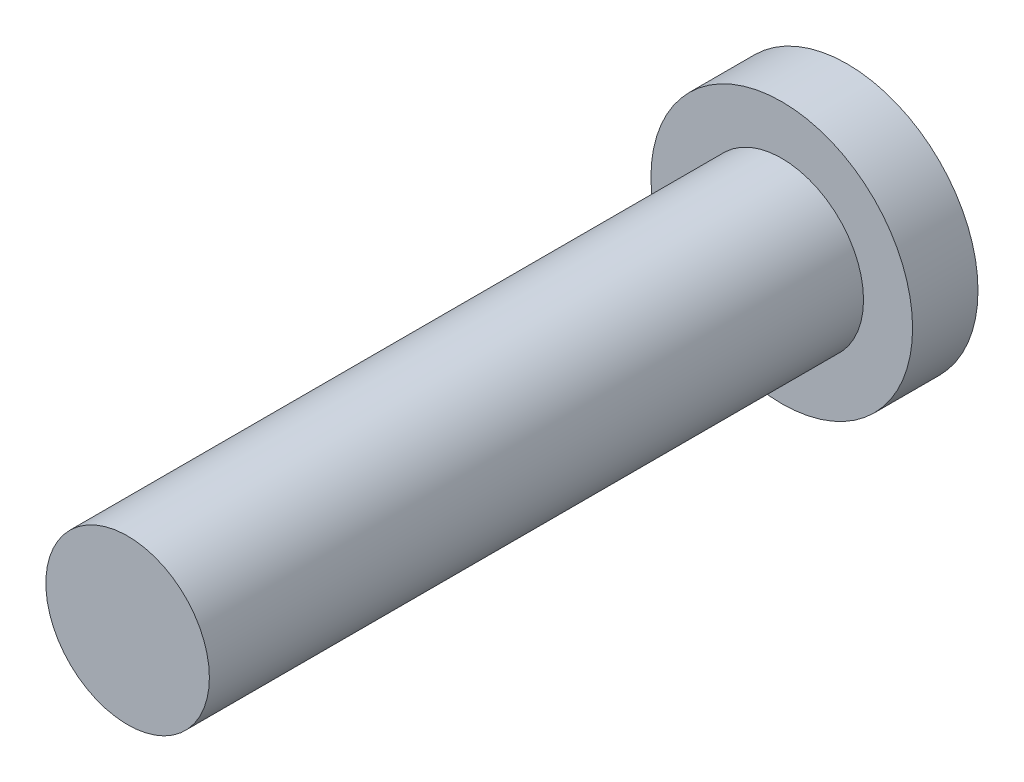
ISO-10303-21;
HEADER;
FILE_DESCRIPTION(('STEP AP214'),'2;1');
FILE_NAME('part.step','',(''),(''),'','','');
FILE_SCHEMA(('AUTOMOTIVE_DESIGN { 1 0 10303 214 1 1 1 1 }'));
ENDSEC;
DATA;
#1=APPLICATION_CONTEXT('core data for automotive mechanical design processes');
#2=APPLICATION_PROTOCOL_DEFINITION('international standard','automotive_design',2000,#1);
#3=PRODUCT_CONTEXT('',#1,'mechanical');
#4=PRODUCT('Part','Part','',(#3));
#5=PRODUCT_RELATED_PRODUCT_CATEGORY('part','',(#4));
#6=PRODUCT_DEFINITION_FORMATION('','',#4);
#7=PRODUCT_DEFINITION_CONTEXT('part definition',#1,'design');
#8=PRODUCT_DEFINITION('design','',#6,#7);
#9=PRODUCT_DEFINITION_SHAPE('','',#8);
#10=(LENGTH_UNIT() NAMED_UNIT(*) SI_UNIT(.MILLI.,.METRE.));
#11=(NAMED_UNIT(*) PLANE_ANGLE_UNIT() SI_UNIT($,.RADIAN.));
#12=(NAMED_UNIT(*) SI_UNIT($,.STERADIAN.) SOLID_ANGLE_UNIT());
#13=UNCERTAINTY_MEASURE_WITH_UNIT(LENGTH_MEASURE(1.E-05),#10,'distance_accuracy_value','');
#14=(GEOMETRIC_REPRESENTATION_CONTEXT(3) GLOBAL_UNCERTAINTY_ASSIGNED_CONTEXT((#13)) GLOBAL_UNIT_ASSIGNED_CONTEXT((#10,
#11,#12)) REPRESENTATION_CONTEXT('',''));
#15=CARTESIAN_POINT('',(0.,0.,0.));
#16=DIRECTION('',(0.,0.,1.));
#17=DIRECTION('',(1.,0.,0.));
#18=AXIS2_PLACEMENT_3D('',#15,#16,#17);
#19=CARTESIAN_POINT('',(0.,0.,2.));
#20=DIRECTION('',(0.,0.,-1.));
#21=DIRECTION('',(-1.,0.,0.));
#22=AXIS2_PLACEMENT_3D('',#19,#20,#21);
#23=CYLINDRICAL_SURFACE('',#22,4.);
#24=CARTESIAN_POINT('',(0.,0.,2.));
#25=DIRECTION('',(0.,0.,1.));
#26=DIRECTION('',(1.,0.,0.));
#27=AXIS2_PLACEMENT_3D('',#24,#25,#26);
#28=CIRCLE('',#27,4.);
#29=CARTESIAN_POINT('',(4.,0.,2.));
#30=VERTEX_POINT('',#29);
#31=EDGE_CURVE('E10',#30,#30,#28,.T.);
#32=ORIENTED_EDGE('',*,*,#31,.F.);
#33=EDGE_LOOP('',(#32));
#34=FACE_BOUND('',#33,.T.);
#35=CARTESIAN_POINT('',(0.,0.,0.));
#36=DIRECTION('',(0.,0.,1.));
#37=DIRECTION('',(1.,0.,0.));
#38=AXIS2_PLACEMENT_3D('',#35,#36,#37);
#39=CIRCLE('',#38,4.);
#40=CARTESIAN_POINT('',(4.,0.,0.));
#41=VERTEX_POINT('',#40);
#42=EDGE_CURVE('E36',#41,#41,#39,.T.);
#43=ORIENTED_EDGE('',*,*,#42,.T.);
#44=EDGE_LOOP('',(#43));
#45=FACE_BOUND('',#44,.T.);
#46=ADVANCED_FACE('F33',(#34,#45),#23,.T.);
#47=CARTESIAN_POINT('',(0.,0.,2.));
#48=DIRECTION('',(0.,0.,1.));
#49=DIRECTION('',(1.,0.,0.));
#50=AXIS2_PLACEMENT_3D('',#47,#48,#49);
#51=PLANE('',#50);
#52=CARTESIAN_POINT('',(0.,0.,2.));
#53=DIRECTION('',(0.,0.,1.));
#54=DIRECTION('',(1.,0.,0.));
#55=AXIS2_PLACEMENT_3D('',#52,#53,#54);
#56=CIRCLE('',#55,2.5);
#57=CARTESIAN_POINT('',(2.5,0.,2.));
#58=VERTEX_POINT('',#57);
#59=EDGE_CURVE('E45',#58,#58,#56,.T.);
#60=ORIENTED_EDGE('',*,*,#59,.F.);
#61=EDGE_LOOP('',(#60));
#62=FACE_BOUND('',#61,.T.);
#63=ORIENTED_EDGE('',*,*,#31,.T.);
#64=EDGE_LOOP('',(#63));
#65=FACE_BOUND('',#64,.T.);
#66=ADVANCED_FACE('F60',(#62,#65),#51,.T.);
#67=CARTESIAN_POINT('',(0.,0.,0.));
#68=DIRECTION('',(0.,0.,1.));
#69=DIRECTION('',(1.,0.,0.));
#70=AXIS2_PLACEMENT_3D('',#67,#68,#69);
#71=PLANE('',#70);
#72=ORIENTED_EDGE('',*,*,#42,.F.);
#73=EDGE_LOOP('',(#72));
#74=FACE_BOUND('',#73,.T.);
#75=ADVANCED_FACE('F56',(#74),#71,.F.);
#76=CARTESIAN_POINT('',(0.,0.,22.));
#77=DIRECTION('',(0.,0.,-1.));
#78=DIRECTION('',(-1.,0.,0.));
#79=AXIS2_PLACEMENT_3D('',#76,#77,#78);
#80=CYLINDRICAL_SURFACE('',#79,2.5);
#81=CARTESIAN_POINT('',(0.,0.,22.));
#82=DIRECTION('',(0.,0.,1.));
#83=DIRECTION('',(1.,0.,0.));
#84=AXIS2_PLACEMENT_3D('',#81,#82,#83);
#85=CIRCLE('',#84,2.5);
#86=CARTESIAN_POINT('',(2.5,0.,22.));
#87=VERTEX_POINT('',#86);
#88=EDGE_CURVE('E43',#87,#87,#85,.T.);
#89=ORIENTED_EDGE('',*,*,#88,.F.);
#90=EDGE_LOOP('',(#89));
#91=FACE_BOUND('',#90,.T.);
#92=ORIENTED_EDGE('',*,*,#59,.T.);
#93=EDGE_LOOP('',(#92));
#94=FACE_BOUND('',#93,.T.);
#95=ADVANCED_FACE('F53',(#91,#94),#80,.T.);
#96=CARTESIAN_POINT('',(0.,0.,22.));
#97=DIRECTION('',(0.,0.,1.));
#98=DIRECTION('',(1.,0.,0.));
#99=AXIS2_PLACEMENT_3D('',#96,#97,#98);
#100=PLANE('',#99);
#101=ORIENTED_EDGE('',*,*,#88,.T.);
#102=EDGE_LOOP('',(#101));
#103=FACE_BOUND('',#102,.T.);
#104=ADVANCED_FACE('F51',(#103),#100,.T.);
#105=CLOSED_SHELL('',(#46,#66,#75,#95,#104));
#106=MANIFOLD_SOLID_BREP('B2',#105);
#107=ADVANCED_BREP_SHAPE_REPRESENTATION('',(#18,#106),#14);
#108=SHAPE_DEFINITION_REPRESENTATION(#9,#107);
ENDSEC;
END-ISO-10303-21;
